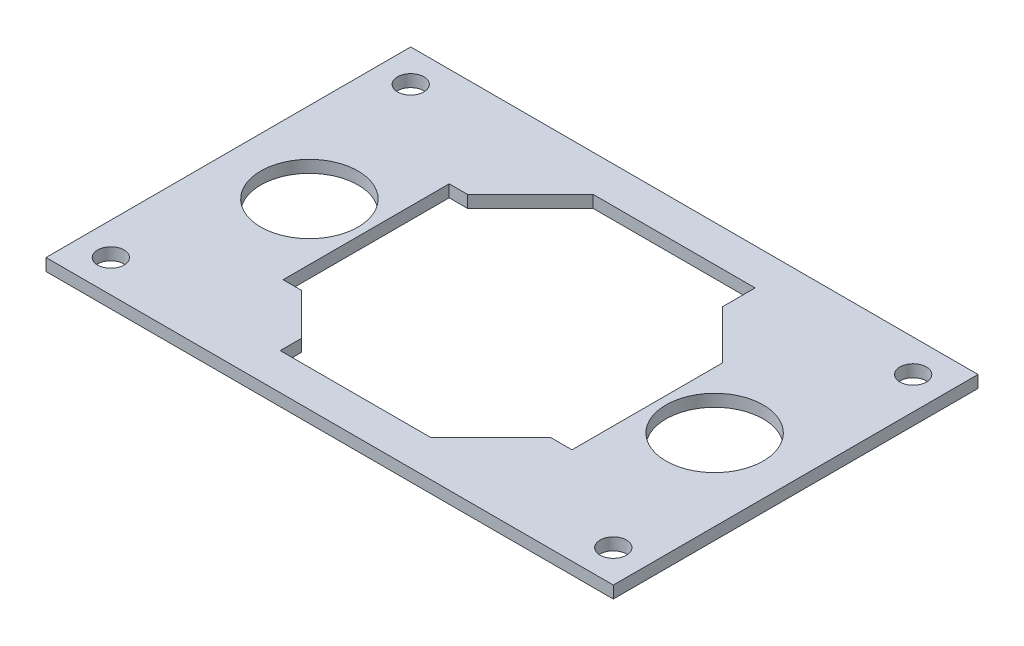
ISO-10303-21;
HEADER;
FILE_DESCRIPTION(('STEP AP214'),'2;1');
FILE_NAME('part.step','',(''),(''),'','','');
FILE_SCHEMA(('AUTOMOTIVE_DESIGN { 1 0 10303 214 1 1 1 1 }'));
ENDSEC;
DATA;
#1=APPLICATION_CONTEXT('core data for automotive mechanical design processes');
#2=APPLICATION_PROTOCOL_DEFINITION('international standard','automotive_design',2000,#1);
#3=PRODUCT_CONTEXT('',#1,'mechanical');
#4=PRODUCT('Part','Part','',(#3));
#5=PRODUCT_RELATED_PRODUCT_CATEGORY('part','',(#4));
#6=PRODUCT_DEFINITION_FORMATION('','',#4);
#7=PRODUCT_DEFINITION_CONTEXT('part definition',#1,'design');
#8=PRODUCT_DEFINITION('design','',#6,#7);
#9=PRODUCT_DEFINITION_SHAPE('','',#8);
#10=(LENGTH_UNIT() NAMED_UNIT(*) SI_UNIT(.MILLI.,.METRE.));
#11=(NAMED_UNIT(*) PLANE_ANGLE_UNIT() SI_UNIT($,.RADIAN.));
#12=(NAMED_UNIT(*) SI_UNIT($,.STERADIAN.) SOLID_ANGLE_UNIT());
#13=UNCERTAINTY_MEASURE_WITH_UNIT(LENGTH_MEASURE(1.E-05),#10,'distance_accuracy_value','');
#14=(GEOMETRIC_REPRESENTATION_CONTEXT(3) GLOBAL_UNCERTAINTY_ASSIGNED_CONTEXT((#13)) GLOBAL_UNIT_ASSIGNED_CONTEXT((#10,
#11,#12)) REPRESENTATION_CONTEXT('',''));
#15=CARTESIAN_POINT('',(0.,0.,0.));
#16=DIRECTION('',(0.,0.,1.));
#17=DIRECTION('',(1.,0.,0.));
#18=AXIS2_PLACEMENT_3D('',#15,#16,#17);
#19=CARTESIAN_POINT('',(-35.,1.5,22.5));
#20=DIRECTION('',(1.,0.,0.));
#21=DIRECTION('',(0.,0.,-1.));
#22=AXIS2_PLACEMENT_3D('',#19,#20,#21);
#23=PLANE('',#22);
#24=DIRECTION('',(0.,0.,1.));
#25=VECTOR('',#24,1.);
#26=CARTESIAN_POINT('',(-35.,0.,22.5));
#27=LINE('',#26,#25);
#28=CARTESIAN_POINT('',(-35.,0.,-22.5));
#29=VERTEX_POINT('',#28);
#30=CARTESIAN_POINT('',(-35.,0.,22.5));
#31=VERTEX_POINT('',#30);
#32=EDGE_CURVE('E291',#29,#31,#27,.T.);
#33=ORIENTED_EDGE('',*,*,#32,.T.);
#34=DIRECTION('',(0.,-1.,0.));
#35=VECTOR('',#34,1.);
#36=CARTESIAN_POINT('',(-35.,1.5,22.5));
#37=LINE('',#36,#35);
#38=CARTESIAN_POINT('',(-35.,1.5,22.5));
#39=VERTEX_POINT('',#38);
#40=EDGE_CURVE('E11',#39,#31,#37,.T.);
#41=ORIENTED_EDGE('',*,*,#40,.F.);
#42=DIRECTION('',(0.,0.,1.));
#43=VECTOR('',#42,1.);
#44=CARTESIAN_POINT('',(-35.,1.5,22.5));
#45=LINE('',#44,#43);
#46=CARTESIAN_POINT('',(-35.,1.5,-22.5));
#47=VERTEX_POINT('',#46);
#48=EDGE_CURVE('E294',#47,#39,#45,.T.);
#49=ORIENTED_EDGE('',*,*,#48,.F.);
#50=DIRECTION('',(0.,-1.,0.));
#51=VECTOR('',#50,1.);
#52=CARTESIAN_POINT('',(-35.,1.5,-22.5));
#53=LINE('',#52,#51);
#54=EDGE_CURVE('E304',#47,#29,#53,.T.);
#55=ORIENTED_EDGE('',*,*,#54,.T.);
#56=EDGE_LOOP('',(#33,#41,#49,#55));
#57=FACE_BOUND('',#56,.T.);
#58=ADVANCED_FACE('F31',(#57),#23,.F.);
#59=CARTESIAN_POINT('',(-35.,1.5,22.5));
#60=DIRECTION('',(0.,0.,-1.));
#61=DIRECTION('',(-1.,0.,0.));
#62=AXIS2_PLACEMENT_3D('',#59,#60,#61);
#63=PLANE('',#62);
#64=DIRECTION('',(1.,0.,0.));
#65=VECTOR('',#64,1.);
#66=CARTESIAN_POINT('',(-35.,0.,22.5));
#67=LINE('',#66,#65);
#68=CARTESIAN_POINT('',(35.,0.,22.5));
#69=VERTEX_POINT('',#68);
#70=EDGE_CURVE('E307',#31,#69,#67,.T.);
#71=ORIENTED_EDGE('',*,*,#70,.T.);
#72=DIRECTION('',(0.,-1.,0.));
#73=VECTOR('',#72,1.);
#74=CARTESIAN_POINT('',(35.,1.5,22.5));
#75=LINE('',#74,#73);
#76=CARTESIAN_POINT('',(35.,1.5,22.5));
#77=VERTEX_POINT('',#76);
#78=EDGE_CURVE('E38',#77,#69,#75,.T.);
#79=ORIENTED_EDGE('',*,*,#78,.F.);
#80=DIRECTION('',(1.,0.,0.));
#81=VECTOR('',#80,1.);
#82=CARTESIAN_POINT('',(-35.,1.5,22.5));
#83=LINE('',#82,#81);
#84=EDGE_CURVE('E297',#39,#77,#83,.T.);
#85=ORIENTED_EDGE('',*,*,#84,.F.);
#86=ORIENTED_EDGE('',*,*,#40,.T.);
#87=EDGE_LOOP('',(#71,#79,#85,#86));
#88=FACE_BOUND('',#87,.T.);
#89=ADVANCED_FACE('F336',(#88),#63,.F.);
#90=CARTESIAN_POINT('',(35.,1.5,22.5));
#91=DIRECTION('',(-1.,0.,0.));
#92=DIRECTION('',(0.,0.,1.));
#93=AXIS2_PLACEMENT_3D('',#90,#91,#92);
#94=PLANE('',#93);
#95=DIRECTION('',(0.,0.,-1.));
#96=VECTOR('',#95,1.);
#97=CARTESIAN_POINT('',(35.,0.,22.5));
#98=LINE('',#97,#96);
#99=CARTESIAN_POINT('',(35.,0.,-22.5));
#100=VERTEX_POINT('',#99);
#101=EDGE_CURVE('E309',#69,#100,#98,.T.);
#102=ORIENTED_EDGE('',*,*,#101,.T.);
#103=DIRECTION('',(0.,-1.,0.));
#104=VECTOR('',#103,1.);
#105=CARTESIAN_POINT('',(35.,1.5,-22.5));
#106=LINE('',#105,#104);
#107=CARTESIAN_POINT('',(35.,1.5,-22.5));
#108=VERTEX_POINT('',#107);
#109=EDGE_CURVE('E314',#108,#100,#106,.T.);
#110=ORIENTED_EDGE('',*,*,#109,.F.);
#111=DIRECTION('',(0.,0.,-1.));
#112=VECTOR('',#111,1.);
#113=CARTESIAN_POINT('',(35.,1.5,22.5));
#114=LINE('',#113,#112);
#115=EDGE_CURVE('E300',#77,#108,#114,.T.);
#116=ORIENTED_EDGE('',*,*,#115,.F.);
#117=ORIENTED_EDGE('',*,*,#78,.T.);
#118=EDGE_LOOP('',(#102,#110,#116,#117));
#119=FACE_BOUND('',#118,.T.);
#120=ADVANCED_FACE('F321',(#119),#94,.F.);
#121=CARTESIAN_POINT('',(-35.,1.5,-22.5));
#122=DIRECTION('',(0.,0.,1.));
#123=DIRECTION('',(1.,0.,0.));
#124=AXIS2_PLACEMENT_3D('',#121,#122,#123);
#125=PLANE('',#124);
#126=DIRECTION('',(-1.,0.,0.));
#127=VECTOR('',#126,1.);
#128=CARTESIAN_POINT('',(-35.,0.,-22.5));
#129=LINE('',#128,#127);
#130=EDGE_CURVE('E298',#100,#29,#129,.T.);
#131=ORIENTED_EDGE('',*,*,#130,.T.);
#132=ORIENTED_EDGE('',*,*,#54,.F.);
#133=DIRECTION('',(-1.,0.,0.));
#134=VECTOR('',#133,1.);
#135=CARTESIAN_POINT('',(-35.,1.5,-22.5));
#136=LINE('',#135,#134);
#137=EDGE_CURVE('E302',#108,#47,#136,.T.);
#138=ORIENTED_EDGE('',*,*,#137,.F.);
#139=ORIENTED_EDGE('',*,*,#109,.T.);
#140=EDGE_LOOP('',(#131,#132,#138,#139));
#141=FACE_BOUND('',#140,.T.);
#142=ADVANCED_FACE('F329',(#141),#125,.F.);
#143=CARTESIAN_POINT('',(-35.,1.5,-22.5));
#144=DIRECTION('',(0.,-1.,0.));
#145=DIRECTION('',(0.,0.,-1.));
#146=AXIS2_PLACEMENT_3D('',#143,#144,#145);
#147=PLANE('',#146);
#148=DIRECTION('',(0.707106781186543,0.,-0.707106781186552));
#149=VECTOR('',#148,1.);
#150=CARTESIAN_POINT('',(15.4,1.5,10.6));
#151=LINE('',#150,#149);
#152=CARTESIAN_POINT('',(8.00000000000009,1.5,18.));
#153=VERTEX_POINT('',#152);
#154=CARTESIAN_POINT('',(15.4,1.5,10.6));
#155=VERTEX_POINT('',#154);
#156=EDGE_CURVE('E203',#153,#155,#151,.T.);
#157=ORIENTED_EDGE('',*,*,#156,.F.);
#158=DIRECTION('',(1.,0.,0.));
#159=VECTOR('',#158,1.);
#160=CARTESIAN_POINT('',(-10.5999999999999,1.5,18.));
#161=LINE('',#160,#159);
#162=CARTESIAN_POINT('',(-10.5999999999999,1.5,18.));
#163=VERTEX_POINT('',#162);
#164=EDGE_CURVE('E45',#163,#153,#161,.T.);
#165=ORIENTED_EDGE('',*,*,#164,.F.);
#166=DIRECTION('',(0.,0.,1.));
#167=VECTOR('',#166,1.);
#168=CARTESIAN_POINT('',(-10.5999999999999,1.5,18.));
#169=LINE('',#168,#167);
#170=CARTESIAN_POINT('',(-10.5999999999999,1.5,15.4));
#171=VERTEX_POINT('',#170);
#172=EDGE_CURVE('E168',#171,#163,#169,.T.);
#173=ORIENTED_EDGE('',*,*,#172,.F.);
#174=DIRECTION('',(0.707106781186551,0.,0.707106781186544));
#175=VECTOR('',#174,1.);
#176=CARTESIAN_POINT('',(-10.5999999999999,1.5,15.4));
#177=LINE('',#176,#175);
#178=CARTESIAN_POINT('',(-15.75,1.5,10.25));
#179=VERTEX_POINT('',#178);
#180=EDGE_CURVE('E171',#179,#171,#177,.T.);
#181=ORIENTED_EDGE('',*,*,#180,.F.);
#182=DIRECTION('',(1.,0.,0.));
#183=VECTOR('',#182,1.);
#184=CARTESIAN_POINT('',(-15.75,1.5,10.25));
#185=LINE('',#184,#183);
#186=CARTESIAN_POINT('',(-18.,1.5,10.25));
#187=VERTEX_POINT('',#186);
#188=EDGE_CURVE('E229',#187,#179,#185,.T.);
#189=ORIENTED_EDGE('',*,*,#188,.F.);
#190=DIRECTION('',(0.,0.,1.));
#191=VECTOR('',#190,1.);
#192=CARTESIAN_POINT('',(-18.,1.5,-10.25));
#193=LINE('',#192,#191);
#194=CARTESIAN_POINT('',(-18.,1.5,-10.25));
#195=VERTEX_POINT('',#194);
#196=EDGE_CURVE('E226',#195,#187,#193,.T.);
#197=ORIENTED_EDGE('',*,*,#196,.F.);
#198=DIRECTION('',(-1.,0.,0.));
#199=VECTOR('',#198,1.);
#200=CARTESIAN_POINT('',(-18.,1.5,-10.25));
#201=LINE('',#200,#199);
#202=CARTESIAN_POINT('',(-15.75,1.5,-10.25));
#203=VERTEX_POINT('',#202);
#204=EDGE_CURVE('E223',#203,#195,#201,.T.);
#205=ORIENTED_EDGE('',*,*,#204,.F.);
#206=DIRECTION('',(-0.707106781186543,0.,0.707106781186552));
#207=VECTOR('',#206,1.);
#208=CARTESIAN_POINT('',(-15.75,1.5,-10.25));
#209=LINE('',#208,#207);
#210=CARTESIAN_POINT('',(-8.00000000000009,1.5,-18.));
#211=VERTEX_POINT('',#210);
#212=EDGE_CURVE('E220',#211,#203,#209,.T.);
#213=ORIENTED_EDGE('',*,*,#212,.F.);
#214=DIRECTION('',(-1.,0.,0.));
#215=VECTOR('',#214,1.);
#216=CARTESIAN_POINT('',(-8.00000000000009,1.5,-18.));
#217=LINE('',#216,#215);
#218=CARTESIAN_POINT('',(12.,1.5,-18.));
#219=VERTEX_POINT('',#218);
#220=EDGE_CURVE('E217',#219,#211,#217,.T.);
#221=ORIENTED_EDGE('',*,*,#220,.F.);
#222=DIRECTION('',(0.,0.,-1.));
#223=VECTOR('',#222,1.);
#224=CARTESIAN_POINT('',(12.,1.5,-18.));
#225=LINE('',#224,#223);
#226=CARTESIAN_POINT('',(12.,1.5,-14.));
#227=VERTEX_POINT('',#226);
#228=EDGE_CURVE('E214',#227,#219,#225,.T.);
#229=ORIENTED_EDGE('',*,*,#228,.F.);
#230=DIRECTION('',(-0.707106781186552,0.,-0.707106781186543));
#231=VECTOR('',#230,1.);
#232=CARTESIAN_POINT('',(12.,1.5,-14.));
#233=LINE('',#232,#231);
#234=CARTESIAN_POINT('',(18.,1.5,-8.00000000000007));
#235=VERTEX_POINT('',#234);
#236=EDGE_CURVE('E211',#235,#227,#233,.T.);
#237=ORIENTED_EDGE('',*,*,#236,.F.);
#238=DIRECTION('',(0.,0.,-1.));
#239=VECTOR('',#238,1.);
#240=CARTESIAN_POINT('',(18.,1.5,-8.00000000000007));
#241=LINE('',#240,#239);
#242=CARTESIAN_POINT('',(18.,1.5,10.6));
#243=VERTEX_POINT('',#242);
#244=EDGE_CURVE('E208',#243,#235,#241,.T.);
#245=ORIENTED_EDGE('',*,*,#244,.F.);
#246=DIRECTION('',(1.,0.,0.));
#247=VECTOR('',#246,1.);
#248=CARTESIAN_POINT('',(18.,1.5,10.6));
#249=LINE('',#248,#247);
#250=EDGE_CURVE('E205',#155,#243,#249,.T.);
#251=ORIENTED_EDGE('',*,*,#250,.F.);
#252=EDGE_LOOP('',(#157,#165,#173,#181,#189,#197,#205,#213,#221,#229,#237,#245,#251));
#253=FACE_BOUND('',#252,.T.);
#254=CARTESIAN_POINT('',(25.,1.5,0.));
#255=DIRECTION('',(0.,1.,0.));
#256=DIRECTION('',(0.,0.,1.));
#257=AXIS2_PLACEMENT_3D('',#254,#255,#256);
#258=CIRCLE('',#257,6.);
#259=CARTESIAN_POINT('',(25.,1.5,6.));
#260=VERTEX_POINT('',#259);
#261=EDGE_CURVE('E236',#260,#260,#258,.T.);
#262=ORIENTED_EDGE('',*,*,#261,.F.);
#263=EDGE_LOOP('',(#262));
#264=FACE_BOUND('',#263,.T.);
#265=CARTESIAN_POINT('',(-25.,1.5,0.));
#266=DIRECTION('',(0.,1.,0.));
#267=DIRECTION('',(0.,0.,1.));
#268=AXIS2_PLACEMENT_3D('',#265,#266,#267);
#269=CIRCLE('',#268,6.);
#270=CARTESIAN_POINT('',(-25.,1.5,6.));
#271=VERTEX_POINT('',#270);
#272=EDGE_CURVE('E261',#271,#271,#269,.T.);
#273=ORIENTED_EDGE('',*,*,#272,.F.);
#274=EDGE_LOOP('',(#273));
#275=FACE_BOUND('',#274,.T.);
#276=CARTESIAN_POINT('',(31.,1.5,18.5));
#277=DIRECTION('',(0.,1.,0.));
#278=DIRECTION('',(0.,0.,1.));
#279=AXIS2_PLACEMENT_3D('',#276,#277,#278);
#280=CIRCLE('',#279,1.625);
#281=CARTESIAN_POINT('',(31.,1.5,20.125));
#282=VERTEX_POINT('',#281);
#283=EDGE_CURVE('E267',#282,#282,#280,.T.);
#284=ORIENTED_EDGE('',*,*,#283,.F.);
#285=EDGE_LOOP('',(#284));
#286=FACE_BOUND('',#285,.T.);
#287=CARTESIAN_POINT('',(31.,1.5,-18.5));
#288=DIRECTION('',(0.,1.,0.));
#289=DIRECTION('',(0.,0.,1.));
#290=AXIS2_PLACEMENT_3D('',#287,#288,#289);
#291=CIRCLE('',#290,1.625);
#292=CARTESIAN_POINT('',(31.,1.5,-16.875));
#293=VERTEX_POINT('',#292);
#294=EDGE_CURVE('E273',#293,#293,#291,.T.);
#295=ORIENTED_EDGE('',*,*,#294,.F.);
#296=EDGE_LOOP('',(#295));
#297=FACE_BOUND('',#296,.T.);
#298=CARTESIAN_POINT('',(-31.,1.5,-18.5));
#299=DIRECTION('',(0.,1.,0.));
#300=DIRECTION('',(0.,0.,1.));
#301=AXIS2_PLACEMENT_3D('',#298,#299,#300);
#302=CIRCLE('',#301,1.625);
#303=CARTESIAN_POINT('',(-31.,1.5,-16.875));
#304=VERTEX_POINT('',#303);
#305=EDGE_CURVE('E279',#304,#304,#302,.T.);
#306=ORIENTED_EDGE('',*,*,#305,.F.);
#307=EDGE_LOOP('',(#306));
#308=FACE_BOUND('',#307,.T.);
#309=CARTESIAN_POINT('',(-31.,1.5,18.5));
#310=DIRECTION('',(0.,1.,0.));
#311=DIRECTION('',(0.,0.,1.));
#312=AXIS2_PLACEMENT_3D('',#309,#310,#311);
#313=CIRCLE('',#312,1.625);
#314=CARTESIAN_POINT('',(-31.,1.5,20.125));
#315=VERTEX_POINT('',#314);
#316=EDGE_CURVE('E285',#315,#315,#313,.T.);
#317=ORIENTED_EDGE('',*,*,#316,.F.);
#318=EDGE_LOOP('',(#317));
#319=FACE_BOUND('',#318,.T.);
#320=ORIENTED_EDGE('',*,*,#48,.T.);
#321=ORIENTED_EDGE('',*,*,#84,.T.);
#322=ORIENTED_EDGE('',*,*,#115,.T.);
#323=ORIENTED_EDGE('',*,*,#137,.T.);
#324=EDGE_LOOP('',(#320,#321,#322,#323));
#325=FACE_BOUND('',#324,.T.);
#326=ADVANCED_FACE('F335',(#253,#264,#275,#286,#297,#308,#319,#325),#147,.F.);
#327=CARTESIAN_POINT('',(-35.,0.,-22.5));
#328=DIRECTION('',(0.,-1.,0.));
#329=DIRECTION('',(0.,0.,-1.));
#330=AXIS2_PLACEMENT_3D('',#327,#328,#329);
#331=PLANE('',#330);
#332=DIRECTION('',(1.,0.,0.));
#333=VECTOR('',#332,1.);
#334=CARTESIAN_POINT('',(-10.5999999999999,0.,18.));
#335=LINE('',#334,#333);
#336=CARTESIAN_POINT('',(-10.5999999999999,0.,18.));
#337=VERTEX_POINT('',#336);
#338=CARTESIAN_POINT('',(8.00000000000009,0.,18.));
#339=VERTEX_POINT('',#338);
#340=EDGE_CURVE('E151',#337,#339,#335,.T.);
#341=ORIENTED_EDGE('',*,*,#340,.T.);
#342=DIRECTION('',(0.707106781186543,0.,-0.707106781186552));
#343=VECTOR('',#342,1.);
#344=CARTESIAN_POINT('',(15.4,0.,10.6));
#345=LINE('',#344,#343);
#346=CARTESIAN_POINT('',(15.4,0.,10.6));
#347=VERTEX_POINT('',#346);
#348=EDGE_CURVE('E160',#339,#347,#345,.T.);
#349=ORIENTED_EDGE('',*,*,#348,.T.);
#350=DIRECTION('',(1.,0.,0.));
#351=VECTOR('',#350,1.);
#352=CARTESIAN_POINT('',(18.,0.,10.6));
#353=LINE('',#352,#351);
#354=CARTESIAN_POINT('',(18.,0.,10.6));
#355=VERTEX_POINT('',#354);
#356=EDGE_CURVE('E53',#347,#355,#353,.T.);
#357=ORIENTED_EDGE('',*,*,#356,.T.);
#358=DIRECTION('',(0.,0.,-1.));
#359=VECTOR('',#358,1.);
#360=CARTESIAN_POINT('',(18.,0.,-8.00000000000007));
#361=LINE('',#360,#359);
#362=CARTESIAN_POINT('',(18.,0.,-8.00000000000007));
#363=VERTEX_POINT('',#362);
#364=EDGE_CURVE('E175',#355,#363,#361,.T.);
#365=ORIENTED_EDGE('',*,*,#364,.T.);
#366=DIRECTION('',(-0.707106781186552,0.,-0.707106781186543));
#367=VECTOR('',#366,1.);
#368=CARTESIAN_POINT('',(12.,0.,-14.));
#369=LINE('',#368,#367);
#370=CARTESIAN_POINT('',(12.,0.,-14.));
#371=VERTEX_POINT('',#370);
#372=EDGE_CURVE('E178',#363,#371,#369,.T.);
#373=ORIENTED_EDGE('',*,*,#372,.T.);
#374=DIRECTION('',(0.,0.,-1.));
#375=VECTOR('',#374,1.);
#376=CARTESIAN_POINT('',(12.,0.,-18.));
#377=LINE('',#376,#375);
#378=CARTESIAN_POINT('',(12.,0.,-18.));
#379=VERTEX_POINT('',#378);
#380=EDGE_CURVE('E181',#371,#379,#377,.T.);
#381=ORIENTED_EDGE('',*,*,#380,.T.);
#382=DIRECTION('',(-1.,0.,0.));
#383=VECTOR('',#382,1.);
#384=CARTESIAN_POINT('',(-8.00000000000009,0.,-18.));
#385=LINE('',#384,#383);
#386=CARTESIAN_POINT('',(-8.00000000000009,0.,-18.));
#387=VERTEX_POINT('',#386);
#388=EDGE_CURVE('E184',#379,#387,#385,.T.);
#389=ORIENTED_EDGE('',*,*,#388,.T.);
#390=DIRECTION('',(-0.707106781186543,0.,0.707106781186552));
#391=VECTOR('',#390,1.);
#392=CARTESIAN_POINT('',(-15.75,0.,-10.25));
#393=LINE('',#392,#391);
#394=CARTESIAN_POINT('',(-15.75,0.,-10.25));
#395=VERTEX_POINT('',#394);
#396=EDGE_CURVE('E187',#387,#395,#393,.T.);
#397=ORIENTED_EDGE('',*,*,#396,.T.);
#398=DIRECTION('',(-1.,0.,0.));
#399=VECTOR('',#398,1.);
#400=CARTESIAN_POINT('',(-18.,0.,-10.25));
#401=LINE('',#400,#399);
#402=CARTESIAN_POINT('',(-18.,0.,-10.25));
#403=VERTEX_POINT('',#402);
#404=EDGE_CURVE('E190',#395,#403,#401,.T.);
#405=ORIENTED_EDGE('',*,*,#404,.T.);
#406=DIRECTION('',(0.,0.,1.));
#407=VECTOR('',#406,1.);
#408=CARTESIAN_POINT('',(-18.,0.,-10.25));
#409=LINE('',#408,#407);
#410=CARTESIAN_POINT('',(-18.,0.,10.25));
#411=VERTEX_POINT('',#410);
#412=EDGE_CURVE('E193',#403,#411,#409,.T.);
#413=ORIENTED_EDGE('',*,*,#412,.T.);
#414=DIRECTION('',(1.,0.,0.));
#415=VECTOR('',#414,1.);
#416=CARTESIAN_POINT('',(-15.75,0.,10.25));
#417=LINE('',#416,#415);
#418=CARTESIAN_POINT('',(-15.75,0.,10.25));
#419=VERTEX_POINT('',#418);
#420=EDGE_CURVE('E196',#411,#419,#417,.T.);
#421=ORIENTED_EDGE('',*,*,#420,.T.);
#422=DIRECTION('',(0.707106781186551,0.,0.707106781186544));
#423=VECTOR('',#422,1.);
#424=CARTESIAN_POINT('',(-10.5999999999999,0.,15.4));
#425=LINE('',#424,#423);
#426=CARTESIAN_POINT('',(-10.5999999999999,0.,15.4));
#427=VERTEX_POINT('',#426);
#428=EDGE_CURVE('E199',#419,#427,#425,.T.);
#429=ORIENTED_EDGE('',*,*,#428,.T.);
#430=DIRECTION('',(0.,0.,1.));
#431=VECTOR('',#430,1.);
#432=CARTESIAN_POINT('',(-10.5999999999999,0.,18.));
#433=LINE('',#432,#431);
#434=EDGE_CURVE('E157',#427,#337,#433,.T.);
#435=ORIENTED_EDGE('',*,*,#434,.T.);
#436=EDGE_LOOP('',(#341,#349,#357,#365,#373,#381,#389,#397,#405,#413,#421,#429,#435));
#437=FACE_BOUND('',#436,.T.);
#438=CARTESIAN_POINT('',(25.,0.,0.));
#439=DIRECTION('',(0.,1.,0.));
#440=DIRECTION('',(0.,0.,1.));
#441=AXIS2_PLACEMENT_3D('',#438,#439,#440);
#442=CIRCLE('',#441,6.);
#443=CARTESIAN_POINT('',(25.,0.,6.));
#444=VERTEX_POINT('',#443);
#445=EDGE_CURVE('E258',#444,#444,#442,.T.);
#446=ORIENTED_EDGE('',*,*,#445,.T.);
#447=EDGE_LOOP('',(#446));
#448=FACE_BOUND('',#447,.T.);
#449=CARTESIAN_POINT('',(-25.,0.,0.));
#450=DIRECTION('',(0.,1.,0.));
#451=DIRECTION('',(0.,0.,1.));
#452=AXIS2_PLACEMENT_3D('',#449,#450,#451);
#453=CIRCLE('',#452,6.);
#454=CARTESIAN_POINT('',(-25.,0.,6.));
#455=VERTEX_POINT('',#454);
#456=EDGE_CURVE('E264',#455,#455,#453,.T.);
#457=ORIENTED_EDGE('',*,*,#456,.T.);
#458=EDGE_LOOP('',(#457));
#459=FACE_BOUND('',#458,.T.);
#460=CARTESIAN_POINT('',(31.,0.,18.5));
#461=DIRECTION('',(0.,1.,0.));
#462=DIRECTION('',(0.,0.,1.));
#463=AXIS2_PLACEMENT_3D('',#460,#461,#462);
#464=CIRCLE('',#463,1.625);
#465=CARTESIAN_POINT('',(31.,0.,20.125));
#466=VERTEX_POINT('',#465);
#467=EDGE_CURVE('E270',#466,#466,#464,.T.);
#468=ORIENTED_EDGE('',*,*,#467,.T.);
#469=EDGE_LOOP('',(#468));
#470=FACE_BOUND('',#469,.T.);
#471=CARTESIAN_POINT('',(31.,0.,-18.5));
#472=DIRECTION('',(0.,1.,0.));
#473=DIRECTION('',(0.,0.,1.));
#474=AXIS2_PLACEMENT_3D('',#471,#472,#473);
#475=CIRCLE('',#474,1.625);
#476=CARTESIAN_POINT('',(31.,0.,-16.875));
#477=VERTEX_POINT('',#476);
#478=EDGE_CURVE('E276',#477,#477,#475,.T.);
#479=ORIENTED_EDGE('',*,*,#478,.T.);
#480=EDGE_LOOP('',(#479));
#481=FACE_BOUND('',#480,.T.);
#482=CARTESIAN_POINT('',(-31.,0.,-18.5));
#483=DIRECTION('',(0.,1.,0.));
#484=DIRECTION('',(0.,0.,1.));
#485=AXIS2_PLACEMENT_3D('',#482,#483,#484);
#486=CIRCLE('',#485,1.625);
#487=CARTESIAN_POINT('',(-31.,0.,-16.875));
#488=VERTEX_POINT('',#487);
#489=EDGE_CURVE('E282',#488,#488,#486,.T.);
#490=ORIENTED_EDGE('',*,*,#489,.T.);
#491=EDGE_LOOP('',(#490));
#492=FACE_BOUND('',#491,.T.);
#493=CARTESIAN_POINT('',(-31.,0.,18.5));
#494=DIRECTION('',(0.,1.,0.));
#495=DIRECTION('',(0.,0.,1.));
#496=AXIS2_PLACEMENT_3D('',#493,#494,#495);
#497=CIRCLE('',#496,1.625);
#498=CARTESIAN_POINT('',(-31.,0.,20.125));
#499=VERTEX_POINT('',#498);
#500=EDGE_CURVE('E288',#499,#499,#497,.T.);
#501=ORIENTED_EDGE('',*,*,#500,.T.);
#502=EDGE_LOOP('',(#501));
#503=FACE_BOUND('',#502,.T.);
#504=ORIENTED_EDGE('',*,*,#32,.F.);
#505=ORIENTED_EDGE('',*,*,#130,.F.);
#506=ORIENTED_EDGE('',*,*,#101,.F.);
#507=ORIENTED_EDGE('',*,*,#70,.F.);
#508=EDGE_LOOP('',(#504,#505,#506,#507));
#509=FACE_BOUND('',#508,.T.);
#510=ADVANCED_FACE('F164',(#437,#448,#459,#470,#481,#492,#503,#509),#331,.T.);
#511=CARTESIAN_POINT('',(-31.,0.,18.5));
#512=DIRECTION('',(0.,1.,0.));
#513=DIRECTION('',(0.,0.,1.));
#514=AXIS2_PLACEMENT_3D('',#511,#512,#513);
#515=CYLINDRICAL_SURFACE('',#514,1.625);
#516=ORIENTED_EDGE('',*,*,#500,.F.);
#517=EDGE_LOOP('',(#516));
#518=FACE_BOUND('',#517,.T.);
#519=ORIENTED_EDGE('',*,*,#316,.T.);
#520=EDGE_LOOP('',(#519));
#521=FACE_BOUND('',#520,.T.);
#522=ADVANCED_FACE('F348',(#518,#521),#515,.F.);
#523=CARTESIAN_POINT('',(-31.,0.,-18.5));
#524=DIRECTION('',(0.,1.,0.));
#525=DIRECTION('',(0.,0.,1.));
#526=AXIS2_PLACEMENT_3D('',#523,#524,#525);
#527=CYLINDRICAL_SURFACE('',#526,1.625);
#528=ORIENTED_EDGE('',*,*,#489,.F.);
#529=EDGE_LOOP('',(#528));
#530=FACE_BOUND('',#529,.T.);
#531=ORIENTED_EDGE('',*,*,#305,.T.);
#532=EDGE_LOOP('',(#531));
#533=FACE_BOUND('',#532,.T.);
#534=ADVANCED_FACE('F354',(#530,#533),#527,.F.);
#535=CARTESIAN_POINT('',(31.,0.,-18.5));
#536=DIRECTION('',(0.,1.,0.));
#537=DIRECTION('',(0.,0.,1.));
#538=AXIS2_PLACEMENT_3D('',#535,#536,#537);
#539=CYLINDRICAL_SURFACE('',#538,1.625);
#540=ORIENTED_EDGE('',*,*,#478,.F.);
#541=EDGE_LOOP('',(#540));
#542=FACE_BOUND('',#541,.T.);
#543=ORIENTED_EDGE('',*,*,#294,.T.);
#544=EDGE_LOOP('',(#543));
#545=FACE_BOUND('',#544,.T.);
#546=ADVANCED_FACE('F358',(#542,#545),#539,.F.);
#547=CARTESIAN_POINT('',(31.,0.,18.5));
#548=DIRECTION('',(0.,1.,0.));
#549=DIRECTION('',(0.,0.,1.));
#550=AXIS2_PLACEMENT_3D('',#547,#548,#549);
#551=CYLINDRICAL_SURFACE('',#550,1.625);
#552=ORIENTED_EDGE('',*,*,#467,.F.);
#553=EDGE_LOOP('',(#552));
#554=FACE_BOUND('',#553,.T.);
#555=ORIENTED_EDGE('',*,*,#283,.T.);
#556=EDGE_LOOP('',(#555));
#557=FACE_BOUND('',#556,.T.);
#558=ADVANCED_FACE('F362',(#554,#557),#551,.F.);
#559=CARTESIAN_POINT('',(-25.,0.,0.));
#560=DIRECTION('',(0.,1.,0.));
#561=DIRECTION('',(0.,0.,1.));
#562=AXIS2_PLACEMENT_3D('',#559,#560,#561);
#563=CYLINDRICAL_SURFACE('',#562,6.);
#564=ORIENTED_EDGE('',*,*,#456,.F.);
#565=EDGE_LOOP('',(#564));
#566=FACE_BOUND('',#565,.T.);
#567=ORIENTED_EDGE('',*,*,#272,.T.);
#568=EDGE_LOOP('',(#567));
#569=FACE_BOUND('',#568,.T.);
#570=ADVANCED_FACE('F366',(#566,#569),#563,.F.);
#571=CARTESIAN_POINT('',(25.,0.,0.));
#572=DIRECTION('',(0.,1.,0.));
#573=DIRECTION('',(0.,0.,1.));
#574=AXIS2_PLACEMENT_3D('',#571,#572,#573);
#575=CYLINDRICAL_SURFACE('',#574,6.);
#576=ORIENTED_EDGE('',*,*,#445,.F.);
#577=EDGE_LOOP('',(#576));
#578=FACE_BOUND('',#577,.T.);
#579=ORIENTED_EDGE('',*,*,#261,.T.);
#580=EDGE_LOOP('',(#579));
#581=FACE_BOUND('',#580,.T.);
#582=ADVANCED_FACE('F370',(#578,#581),#575,.F.);
#583=CARTESIAN_POINT('',(-10.5999999999999,0.,18.));
#584=DIRECTION('',(0.,0.,1.));
#585=DIRECTION('',(1.,0.,0.));
#586=AXIS2_PLACEMENT_3D('',#583,#584,#585);
#587=PLANE('',#586);
#588=ORIENTED_EDGE('',*,*,#164,.T.);
#589=DIRECTION('',(0.,1.,0.));
#590=VECTOR('',#589,1.);
#591=CARTESIAN_POINT('',(8.00000000000009,0.,18.));
#592=LINE('',#591,#590);
#593=EDGE_CURVE('E147',#339,#153,#592,.T.);
#594=ORIENTED_EDGE('',*,*,#593,.F.);
#595=ORIENTED_EDGE('',*,*,#340,.F.);
#596=DIRECTION('',(0.,1.,0.));
#597=VECTOR('',#596,1.);
#598=CARTESIAN_POINT('',(-10.5999999999999,0.,18.));
#599=LINE('',#598,#597);
#600=EDGE_CURVE('E234',#337,#163,#599,.T.);
#601=ORIENTED_EDGE('',*,*,#600,.T.);
#602=EDGE_LOOP('',(#588,#594,#595,#601));
#603=FACE_BOUND('',#602,.T.);
#604=ADVANCED_FACE('F149',(#603),#587,.F.);
#605=CARTESIAN_POINT('',(-10.5999999999999,0.,18.));
#606=DIRECTION('',(-1.,0.,0.));
#607=DIRECTION('',(0.,0.,1.));
#608=AXIS2_PLACEMENT_3D('',#605,#606,#607);
#609=PLANE('',#608);
#610=ORIENTED_EDGE('',*,*,#172,.T.);
#611=ORIENTED_EDGE('',*,*,#600,.F.);
#612=ORIENTED_EDGE('',*,*,#434,.F.);
#613=DIRECTION('',(0.,1.,0.));
#614=VECTOR('',#613,1.);
#615=CARTESIAN_POINT('',(-10.5999999999999,0.,15.4));
#616=LINE('',#615,#614);
#617=EDGE_CURVE('E237',#427,#171,#616,.T.);
#618=ORIENTED_EDGE('',*,*,#617,.T.);
#619=EDGE_LOOP('',(#610,#611,#612,#618));
#620=FACE_BOUND('',#619,.T.);
#621=ADVANCED_FACE('F377',(#620),#609,.F.);
#622=CARTESIAN_POINT('',(-10.5999999999999,0.,15.4));
#623=DIRECTION('',(-0.707106781186544,0.,0.707106781186551));
#624=DIRECTION('',(0.707106781186551,0.,0.707106781186544));
#625=AXIS2_PLACEMENT_3D('',#622,#623,#624);
#626=PLANE('',#625);
#627=ORIENTED_EDGE('',*,*,#180,.T.);
#628=ORIENTED_EDGE('',*,*,#617,.F.);
#629=ORIENTED_EDGE('',*,*,#428,.F.);
#630=DIRECTION('',(0.,1.,0.));
#631=VECTOR('',#630,1.);
#632=CARTESIAN_POINT('',(-15.75,0.,10.25));
#633=LINE('',#632,#631);
#634=EDGE_CURVE('E239',#419,#179,#633,.T.);
#635=ORIENTED_EDGE('',*,*,#634,.T.);
#636=EDGE_LOOP('',(#627,#628,#629,#635));
#637=FACE_BOUND('',#636,.T.);
#638=ADVANCED_FACE('F414',(#637),#626,.F.);
#639=CARTESIAN_POINT('',(-15.75,0.,10.25));
#640=DIRECTION('',(0.,0.,1.));
#641=DIRECTION('',(1.,0.,0.));
#642=AXIS2_PLACEMENT_3D('',#639,#640,#641);
#643=PLANE('',#642);
#644=ORIENTED_EDGE('',*,*,#188,.T.);
#645=ORIENTED_EDGE('',*,*,#634,.F.);
#646=ORIENTED_EDGE('',*,*,#420,.F.);
#647=DIRECTION('',(0.,1.,0.));
#648=VECTOR('',#647,1.);
#649=CARTESIAN_POINT('',(-18.,0.,10.25));
#650=LINE('',#649,#648);
#651=EDGE_CURVE('E241',#411,#187,#650,.T.);
#652=ORIENTED_EDGE('',*,*,#651,.T.);
#653=EDGE_LOOP('',(#644,#645,#646,#652));
#654=FACE_BOUND('',#653,.T.);
#655=ADVANCED_FACE('F410',(#654),#643,.F.);
#656=CARTESIAN_POINT('',(-18.,0.,-10.25));
#657=DIRECTION('',(-1.,0.,0.));
#658=DIRECTION('',(0.,0.,1.));
#659=AXIS2_PLACEMENT_3D('',#656,#657,#658);
#660=PLANE('',#659);
#661=ORIENTED_EDGE('',*,*,#196,.T.);
#662=ORIENTED_EDGE('',*,*,#651,.F.);
#663=ORIENTED_EDGE('',*,*,#412,.F.);
#664=DIRECTION('',(0.,1.,0.));
#665=VECTOR('',#664,1.);
#666=CARTESIAN_POINT('',(-18.,0.,-10.25));
#667=LINE('',#666,#665);
#668=EDGE_CURVE('E243',#403,#195,#667,.T.);
#669=ORIENTED_EDGE('',*,*,#668,.T.);
#670=EDGE_LOOP('',(#661,#662,#663,#669));
#671=FACE_BOUND('',#670,.T.);
#672=ADVANCED_FACE('F406',(#671),#660,.F.);
#673=CARTESIAN_POINT('',(-18.,0.,-10.25));
#674=DIRECTION('',(0.,0.,-1.));
#675=DIRECTION('',(-1.,0.,0.));
#676=AXIS2_PLACEMENT_3D('',#673,#674,#675);
#677=PLANE('',#676);
#678=ORIENTED_EDGE('',*,*,#204,.T.);
#679=ORIENTED_EDGE('',*,*,#668,.F.);
#680=ORIENTED_EDGE('',*,*,#404,.F.);
#681=DIRECTION('',(0.,1.,0.));
#682=VECTOR('',#681,1.);
#683=CARTESIAN_POINT('',(-15.75,0.,-10.25));
#684=LINE('',#683,#682);
#685=EDGE_CURVE('E245',#395,#203,#684,.T.);
#686=ORIENTED_EDGE('',*,*,#685,.T.);
#687=EDGE_LOOP('',(#678,#679,#680,#686));
#688=FACE_BOUND('',#687,.T.);
#689=ADVANCED_FACE('F402',(#688),#677,.F.);
#690=CARTESIAN_POINT('',(-15.75,0.,-10.25));
#691=DIRECTION('',(-0.707106781186552,0.,-0.707106781186543));
#692=DIRECTION('',(-0.707106781186543,0.,0.707106781186552));
#693=AXIS2_PLACEMENT_3D('',#690,#691,#692);
#694=PLANE('',#693);
#695=ORIENTED_EDGE('',*,*,#212,.T.);
#696=ORIENTED_EDGE('',*,*,#685,.F.);
#697=ORIENTED_EDGE('',*,*,#396,.F.);
#698=DIRECTION('',(0.,1.,0.));
#699=VECTOR('',#698,1.);
#700=CARTESIAN_POINT('',(-8.00000000000009,0.,-18.));
#701=LINE('',#700,#699);
#702=EDGE_CURVE('E247',#387,#211,#701,.T.);
#703=ORIENTED_EDGE('',*,*,#702,.T.);
#704=EDGE_LOOP('',(#695,#696,#697,#703));
#705=FACE_BOUND('',#704,.T.);
#706=ADVANCED_FACE('F398',(#705),#694,.F.);
#707=CARTESIAN_POINT('',(-8.00000000000009,0.,-18.));
#708=DIRECTION('',(0.,0.,-1.));
#709=DIRECTION('',(-1.,0.,0.));
#710=AXIS2_PLACEMENT_3D('',#707,#708,#709);
#711=PLANE('',#710);
#712=ORIENTED_EDGE('',*,*,#220,.T.);
#713=ORIENTED_EDGE('',*,*,#702,.F.);
#714=ORIENTED_EDGE('',*,*,#388,.F.);
#715=DIRECTION('',(0.,1.,0.));
#716=VECTOR('',#715,1.);
#717=CARTESIAN_POINT('',(12.,0.,-18.));
#718=LINE('',#717,#716);
#719=EDGE_CURVE('E249',#379,#219,#718,.T.);
#720=ORIENTED_EDGE('',*,*,#719,.T.);
#721=EDGE_LOOP('',(#712,#713,#714,#720));
#722=FACE_BOUND('',#721,.T.);
#723=ADVANCED_FACE('F394',(#722),#711,.F.);
#724=CARTESIAN_POINT('',(12.,0.,-18.));
#725=DIRECTION('',(1.,0.,0.));
#726=DIRECTION('',(0.,0.,-1.));
#727=AXIS2_PLACEMENT_3D('',#724,#725,#726);
#728=PLANE('',#727);
#729=ORIENTED_EDGE('',*,*,#228,.T.);
#730=ORIENTED_EDGE('',*,*,#719,.F.);
#731=ORIENTED_EDGE('',*,*,#380,.F.);
#732=DIRECTION('',(0.,1.,0.));
#733=VECTOR('',#732,1.);
#734=CARTESIAN_POINT('',(12.,0.,-14.));
#735=LINE('',#734,#733);
#736=EDGE_CURVE('E251',#371,#227,#735,.T.);
#737=ORIENTED_EDGE('',*,*,#736,.T.);
#738=EDGE_LOOP('',(#729,#730,#731,#737));
#739=FACE_BOUND('',#738,.T.);
#740=ADVANCED_FACE('F390',(#739),#728,.F.);
#741=CARTESIAN_POINT('',(12.,0.,-14.));
#742=DIRECTION('',(0.707106781186543,0.,-0.707106781186552));
#743=DIRECTION('',(-0.707106781186552,0.,-0.707106781186543));
#744=AXIS2_PLACEMENT_3D('',#741,#742,#743);
#745=PLANE('',#744);
#746=ORIENTED_EDGE('',*,*,#236,.T.);
#747=ORIENTED_EDGE('',*,*,#736,.F.);
#748=ORIENTED_EDGE('',*,*,#372,.F.);
#749=DIRECTION('',(0.,1.,0.));
#750=VECTOR('',#749,1.);
#751=CARTESIAN_POINT('',(18.,0.,-8.00000000000007));
#752=LINE('',#751,#750);
#753=EDGE_CURVE('E253',#363,#235,#752,.T.);
#754=ORIENTED_EDGE('',*,*,#753,.T.);
#755=EDGE_LOOP('',(#746,#747,#748,#754));
#756=FACE_BOUND('',#755,.T.);
#757=ADVANCED_FACE('F386',(#756),#745,.F.);
#758=CARTESIAN_POINT('',(18.,0.,-8.00000000000007));
#759=DIRECTION('',(1.,0.,0.));
#760=DIRECTION('',(0.,0.,-1.));
#761=AXIS2_PLACEMENT_3D('',#758,#759,#760);
#762=PLANE('',#761);
#763=ORIENTED_EDGE('',*,*,#244,.T.);
#764=ORIENTED_EDGE('',*,*,#753,.F.);
#765=ORIENTED_EDGE('',*,*,#364,.F.);
#766=DIRECTION('',(0.,1.,0.));
#767=VECTOR('',#766,1.);
#768=CARTESIAN_POINT('',(18.,0.,10.6));
#769=LINE('',#768,#767);
#770=EDGE_CURVE('E255',#355,#243,#769,.T.);
#771=ORIENTED_EDGE('',*,*,#770,.T.);
#772=EDGE_LOOP('',(#763,#764,#765,#771));
#773=FACE_BOUND('',#772,.T.);
#774=ADVANCED_FACE('F383',(#773),#762,.F.);
#775=CARTESIAN_POINT('',(18.,0.,10.6));
#776=DIRECTION('',(0.,0.,1.));
#777=DIRECTION('',(1.,0.,0.));
#778=AXIS2_PLACEMENT_3D('',#775,#776,#777);
#779=PLANE('',#778);
#780=ORIENTED_EDGE('',*,*,#250,.T.);
#781=ORIENTED_EDGE('',*,*,#770,.F.);
#782=ORIENTED_EDGE('',*,*,#356,.F.);
#783=DIRECTION('',(0.,1.,0.));
#784=VECTOR('',#783,1.);
#785=CARTESIAN_POINT('',(15.4,0.,10.6));
#786=LINE('',#785,#784);
#787=EDGE_CURVE('E156',#347,#155,#786,.T.);
#788=ORIENTED_EDGE('',*,*,#787,.T.);
#789=EDGE_LOOP('',(#780,#781,#782,#788));
#790=FACE_BOUND('',#789,.T.);
#791=ADVANCED_FACE('F380',(#790),#779,.F.);
#792=CARTESIAN_POINT('',(15.4,0.,10.6));
#793=DIRECTION('',(0.707106781186552,0.,0.707106781186543));
#794=DIRECTION('',(0.707106781186543,0.,-0.707106781186552));
#795=AXIS2_PLACEMENT_3D('',#792,#793,#794);
#796=PLANE('',#795);
#797=ORIENTED_EDGE('',*,*,#156,.T.);
#798=ORIENTED_EDGE('',*,*,#787,.F.);
#799=ORIENTED_EDGE('',*,*,#348,.F.);
#800=ORIENTED_EDGE('',*,*,#593,.T.);
#801=EDGE_LOOP('',(#797,#798,#799,#800));
#802=FACE_BOUND('',#801,.T.);
#803=ADVANCED_FACE('F161',(#802),#796,.F.);
#804=CLOSED_SHELL('',(#58,#89,#120,#142,#326,#510,#522,#534,#546,#558,#570,#582,#604,#621,#638,
#655,#672,#689,#706,#723,#740,#757,#774,#791,#803));
#805=MANIFOLD_SOLID_BREP('B2',#804);
#806=ADVANCED_BREP_SHAPE_REPRESENTATION('',(#18,#805),#14);
#807=SHAPE_DEFINITION_REPRESENTATION(#9,#806);
ENDSEC;
END-ISO-10303-21;
